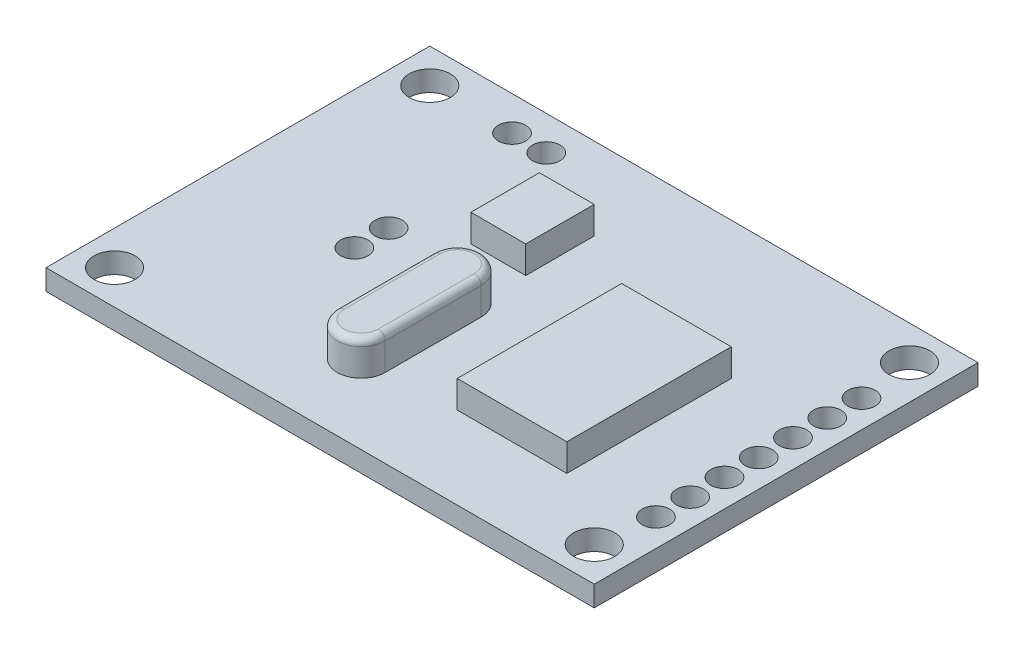
ISO-10303-21;
HEADER;
FILE_DESCRIPTION(('STEP AP214'),'2;1');
FILE_NAME('part.step','',(''),(''),'','','');
FILE_SCHEMA(('AUTOMOTIVE_DESIGN { 1 0 10303 214 1 1 1 1 }'));
ENDSEC;
DATA;
#1=APPLICATION_CONTEXT('core data for automotive mechanical design processes');
#2=APPLICATION_PROTOCOL_DEFINITION('international standard','automotive_design',2000,#1);
#3=PRODUCT_CONTEXT('',#1,'mechanical');
#4=PRODUCT('Part','Part','',(#3));
#5=PRODUCT_RELATED_PRODUCT_CATEGORY('part','',(#4));
#6=PRODUCT_DEFINITION_FORMATION('','',#4);
#7=PRODUCT_DEFINITION_CONTEXT('part definition',#1,'design');
#8=PRODUCT_DEFINITION('design','',#6,#7);
#9=PRODUCT_DEFINITION_SHAPE('','',#8);
#10=(LENGTH_UNIT() NAMED_UNIT(*) SI_UNIT(.MILLI.,.METRE.));
#11=(NAMED_UNIT(*) PLANE_ANGLE_UNIT() SI_UNIT($,.RADIAN.));
#12=(NAMED_UNIT(*) SI_UNIT($,.STERADIAN.) SOLID_ANGLE_UNIT());
#13=UNCERTAINTY_MEASURE_WITH_UNIT(LENGTH_MEASURE(1.E-05),#10,'distance_accuracy_value','');
#14=(GEOMETRIC_REPRESENTATION_CONTEXT(3) GLOBAL_UNCERTAINTY_ASSIGNED_CONTEXT((#13)) GLOBAL_UNIT_ASSIGNED_CONTEXT((#10,
#11,#12)) REPRESENTATION_CONTEXT('',''));
#15=CARTESIAN_POINT('',(0.,0.,0.));
#16=DIRECTION('',(0.,0.,1.));
#17=DIRECTION('',(1.,0.,0.));
#18=AXIS2_PLACEMENT_3D('',#15,#16,#17);
#19=CARTESIAN_POINT('',(0.,1.5,0.));
#20=DIRECTION('',(0.,-1.,0.));
#21=DIRECTION('',(0.,0.,-1.));
#22=AXIS2_PLACEMENT_3D('',#19,#20,#21);
#23=PLANE('',#22);
#24=DIRECTION('',(0.,0.,1.));
#25=VECTOR('',#24,1.);
#26=CARTESIAN_POINT('',(14.,1.5,-22.));
#27=LINE('',#26,#25);
#28=CARTESIAN_POINT('',(14.,1.5,-22.));
#29=VERTEX_POINT('',#28);
#30=CARTESIAN_POINT('',(14.,1.5,-17.));
#31=VERTEX_POINT('',#30);
#32=EDGE_CURVE('E236',#29,#31,#27,.T.);
#33=ORIENTED_EDGE('',*,*,#32,.F.);
#34=DIRECTION('',(-1.,0.,0.));
#35=VECTOR('',#34,1.);
#36=CARTESIAN_POINT('',(14.,1.5,-22.));
#37=LINE('',#36,#35);
#38=CARTESIAN_POINT('',(18.,1.5,-22.));
#39=VERTEX_POINT('',#38);
#40=EDGE_CURVE('E245',#39,#29,#37,.T.);
#41=ORIENTED_EDGE('',*,*,#40,.F.);
#42=DIRECTION('',(0.,0.,-1.));
#43=VECTOR('',#42,1.);
#44=CARTESIAN_POINT('',(18.,1.5,-22.));
#45=LINE('',#44,#43);
#46=CARTESIAN_POINT('',(18.,1.5,-17.));
#47=VERTEX_POINT('',#46);
#48=EDGE_CURVE('E262',#47,#39,#45,.T.);
#49=ORIENTED_EDGE('',*,*,#48,.F.);
#50=DIRECTION('',(1.,0.,0.));
#51=VECTOR('',#50,1.);
#52=CARTESIAN_POINT('',(14.,1.5,-17.));
#53=LINE('',#52,#51);
#54=EDGE_CURVE('E258',#31,#47,#53,.T.);
#55=ORIENTED_EDGE('',*,*,#54,.F.);
#56=EDGE_LOOP('',(#33,#41,#49,#55));
#57=FACE_BOUND('',#56,.T.);
#58=CARTESIAN_POINT('',(37.5,1.5,-2.5));
#59=DIRECTION('',(0.,1.,0.));
#60=DIRECTION('',(0.,0.,1.));
#61=AXIS2_PLACEMENT_3D('',#58,#59,#60);
#62=CIRCLE('',#61,1.5);
#63=CARTESIAN_POINT('',(37.5,1.5,-0.999999999999996));
#64=VERTEX_POINT('',#63);
#65=EDGE_CURVE('E386',#64,#64,#62,.T.);
#66=ORIENTED_EDGE('',*,*,#65,.F.);
#67=EDGE_LOOP('',(#66));
#68=FACE_BOUND('',#67,.T.);
#69=CARTESIAN_POINT('',(37.5,1.5,-25.5));
#70=DIRECTION('',(0.,1.,0.));
#71=DIRECTION('',(0.,0.,1.));
#72=AXIS2_PLACEMENT_3D('',#69,#70,#71);
#73=CIRCLE('',#72,1.5);
#74=CARTESIAN_POINT('',(37.5,1.5,-24.));
#75=VERTEX_POINT('',#74);
#76=EDGE_CURVE('E394',#75,#75,#73,.T.);
#77=ORIENTED_EDGE('',*,*,#76,.F.);
#78=EDGE_LOOP('',(#77));
#79=FACE_BOUND('',#78,.T.);
#80=CARTESIAN_POINT('',(2.5,1.5,-2.5));
#81=DIRECTION('',(0.,1.,0.));
#82=DIRECTION('',(0.,0.,1.));
#83=AXIS2_PLACEMENT_3D('',#80,#81,#82);
#84=CIRCLE('',#83,1.5);
#85=CARTESIAN_POINT('',(2.5,1.5,-0.999999999999999));
#86=VERTEX_POINT('',#85);
#87=EDGE_CURVE('E402',#86,#86,#84,.T.);
#88=ORIENTED_EDGE('',*,*,#87,.F.);
#89=EDGE_LOOP('',(#88));
#90=FACE_BOUND('',#89,.T.);
#91=CARTESIAN_POINT('',(2.5,1.5,-25.5));
#92=DIRECTION('',(0.,1.,0.));
#93=DIRECTION('',(0.,0.,1.));
#94=AXIS2_PLACEMENT_3D('',#91,#92,#93);
#95=CIRCLE('',#94,1.5);
#96=CARTESIAN_POINT('',(2.5,1.5,-24.));
#97=VERTEX_POINT('',#96);
#98=EDGE_CURVE('E410',#97,#97,#95,.T.);
#99=ORIENTED_EDGE('',*,*,#98,.F.);
#100=EDGE_LOOP('',(#99));
#101=FACE_BOUND('',#100,.T.);
#102=DIRECTION('',(0.,0.,1.));
#103=VECTOR('',#102,1.);
#104=CARTESIAN_POINT('',(0.,1.5,0.));
#105=LINE('',#104,#103);
#106=CARTESIAN_POINT('',(0.,1.5,-28.));
#107=VERTEX_POINT('',#106);
#108=CARTESIAN_POINT('',(0.,1.5,0.));
#109=VERTEX_POINT('',#108);
#110=EDGE_CURVE('E418',#107,#109,#105,.T.);
#111=ORIENTED_EDGE('',*,*,#110,.T.);
#112=DIRECTION('',(1.,0.,0.));
#113=VECTOR('',#112,1.);
#114=CARTESIAN_POINT('',(0.,1.5,0.));
#115=LINE('',#114,#113);
#116=CARTESIAN_POINT('',(40.,1.5,0.));
#117=VERTEX_POINT('',#116);
#118=EDGE_CURVE('E422',#109,#117,#115,.T.);
#119=ORIENTED_EDGE('',*,*,#118,.T.);
#120=DIRECTION('',(0.,0.,-1.));
#121=VECTOR('',#120,1.);
#122=CARTESIAN_POINT('',(40.,1.5,0.));
#123=LINE('',#122,#121);
#124=CARTESIAN_POINT('',(40.,1.5,-28.));
#125=VERTEX_POINT('',#124);
#126=EDGE_CURVE('E426',#117,#125,#123,.T.);
#127=ORIENTED_EDGE('',*,*,#126,.T.);
#128=DIRECTION('',(-1.,0.,0.));
#129=VECTOR('',#128,1.);
#130=CARTESIAN_POINT('',(0.,1.5,-28.));
#131=LINE('',#130,#129);
#132=EDGE_CURVE('E429',#125,#107,#131,.T.);
#133=ORIENTED_EDGE('',*,*,#132,.T.);
#134=EDGE_LOOP('',(#111,#119,#127,#133));
#135=FACE_BOUND('',#134,.T.);
#136=CARTESIAN_POINT('',(38.,1.5,-21.5));
#137=DIRECTION('',(0.,1.,0.));
#138=DIRECTION('',(0.,0.,1.));
#139=AXIS2_PLACEMENT_3D('',#136,#137,#138);
#140=CIRCLE('',#139,0.999999999999998);
#141=CARTESIAN_POINT('',(38.,1.5,-20.5));
#142=VERTEX_POINT('',#141);
#143=EDGE_CURVE('E379',#142,#142,#140,.T.);
#144=ORIENTED_EDGE('',*,*,#143,.F.);
#145=EDGE_LOOP('',(#144));
#146=FACE_BOUND('',#145,.T.);
#147=CARTESIAN_POINT('',(38.,1.5,-19.));
#148=DIRECTION('',(0.,1.,0.));
#149=DIRECTION('',(0.,0.,1.));
#150=AXIS2_PLACEMENT_3D('',#147,#148,#149);
#151=CIRCLE('',#150,0.999999999999998);
#152=CARTESIAN_POINT('',(38.,1.5,-18.));
#153=VERTEX_POINT('',#152);
#154=EDGE_CURVE('E371',#153,#153,#151,.T.);
#155=ORIENTED_EDGE('',*,*,#154,.F.);
#156=EDGE_LOOP('',(#155));
#157=FACE_BOUND('',#156,.T.);
#158=CARTESIAN_POINT('',(38.,1.5,-16.5));
#159=DIRECTION('',(0.,1.,0.));
#160=DIRECTION('',(0.,0.,1.));
#161=AXIS2_PLACEMENT_3D('',#158,#159,#160);
#162=CIRCLE('',#161,0.999999999999998);
#163=CARTESIAN_POINT('',(38.,1.5,-15.5));
#164=VERTEX_POINT('',#163);
#165=EDGE_CURVE('E363',#164,#164,#162,.T.);
#166=ORIENTED_EDGE('',*,*,#165,.F.);
#167=EDGE_LOOP('',(#166));
#168=FACE_BOUND('',#167,.T.);
#169=CARTESIAN_POINT('',(38.,1.5,-14.));
#170=DIRECTION('',(0.,1.,0.));
#171=DIRECTION('',(0.,0.,1.));
#172=AXIS2_PLACEMENT_3D('',#169,#170,#171);
#173=CIRCLE('',#172,0.999999999999998);
#174=CARTESIAN_POINT('',(38.,1.5,-13.));
#175=VERTEX_POINT('',#174);
#176=EDGE_CURVE('E355',#175,#175,#173,.T.);
#177=ORIENTED_EDGE('',*,*,#176,.F.);
#178=EDGE_LOOP('',(#177));
#179=FACE_BOUND('',#178,.T.);
#180=CARTESIAN_POINT('',(38.,1.5,-11.5));
#181=DIRECTION('',(0.,1.,0.));
#182=DIRECTION('',(0.,0.,1.));
#183=AXIS2_PLACEMENT_3D('',#180,#181,#182);
#184=CIRCLE('',#183,0.999999999999998);
#185=CARTESIAN_POINT('',(38.,1.5,-10.5));
#186=VERTEX_POINT('',#185);
#187=EDGE_CURVE('E347',#186,#186,#184,.T.);
#188=ORIENTED_EDGE('',*,*,#187,.F.);
#189=EDGE_LOOP('',(#188));
#190=FACE_BOUND('',#189,.T.);
#191=CARTESIAN_POINT('',(38.,1.5,-9.));
#192=DIRECTION('',(0.,1.,0.));
#193=DIRECTION('',(0.,0.,1.));
#194=AXIS2_PLACEMENT_3D('',#191,#192,#193);
#195=CIRCLE('',#194,0.999999999999998);
#196=CARTESIAN_POINT('',(38.,1.5,-8.));
#197=VERTEX_POINT('',#196);
#198=EDGE_CURVE('E339',#197,#197,#195,.T.);
#199=ORIENTED_EDGE('',*,*,#198,.F.);
#200=EDGE_LOOP('',(#199));
#201=FACE_BOUND('',#200,.T.);
#202=CARTESIAN_POINT('',(38.,1.5,-6.5));
#203=DIRECTION('',(0.,1.,0.));
#204=DIRECTION('',(0.,0.,1.));
#205=AXIS2_PLACEMENT_3D('',#202,#203,#204);
#206=CIRCLE('',#205,0.999999999999998);
#207=CARTESIAN_POINT('',(38.,1.5,-5.5));
#208=VERTEX_POINT('',#207);
#209=EDGE_CURVE('E335',#208,#208,#206,.T.);
#210=ORIENTED_EDGE('',*,*,#209,.F.);
#211=EDGE_LOOP('',(#210));
#212=FACE_BOUND('',#211,.T.);
#213=DIRECTION('',(0.,0.,1.));
#214=VECTOR('',#213,1.);
#215=CARTESIAN_POINT('',(24.,1.5,-18.));
#216=LINE('',#215,#214);
#217=CARTESIAN_POINT('',(24.,1.5,-18.));
#218=VERTEX_POINT('',#217);
#219=CARTESIAN_POINT('',(24.,1.5,-6.));
#220=VERTEX_POINT('',#219);
#221=EDGE_CURVE('E284',#218,#220,#216,.T.);
#222=ORIENTED_EDGE('',*,*,#221,.F.);
#223=DIRECTION('',(-1.,0.,0.));
#224=VECTOR('',#223,1.);
#225=CARTESIAN_POINT('',(24.,1.5,-18.));
#226=LINE('',#225,#224);
#227=CARTESIAN_POINT('',(32.,1.5,-18.));
#228=VERTEX_POINT('',#227);
#229=EDGE_CURVE('E290',#228,#218,#226,.T.);
#230=ORIENTED_EDGE('',*,*,#229,.F.);
#231=DIRECTION('',(0.,0.,-1.));
#232=VECTOR('',#231,1.);
#233=CARTESIAN_POINT('',(32.,1.5,-18.));
#234=LINE('',#233,#232);
#235=CARTESIAN_POINT('',(32.,1.5,-6.));
#236=VERTEX_POINT('',#235);
#237=EDGE_CURVE('E307',#236,#228,#234,.T.);
#238=ORIENTED_EDGE('',*,*,#237,.F.);
#239=DIRECTION('',(1.,0.,0.));
#240=VECTOR('',#239,1.);
#241=CARTESIAN_POINT('',(24.,1.5,-6.));
#242=LINE('',#241,#240);
#243=EDGE_CURVE('E303',#220,#236,#242,.T.);
#244=ORIENTED_EDGE('',*,*,#243,.F.);
#245=EDGE_LOOP('',(#222,#230,#238,#244));
#246=FACE_BOUND('',#245,.T.);
#247=CARTESIAN_POINT('',(10.,1.5,-15.));
#248=DIRECTION('',(0.,1.,0.));
#249=DIRECTION('',(0.,0.,1.));
#250=AXIS2_PLACEMENT_3D('',#247,#248,#249);
#251=CIRCLE('',#250,1.);
#252=CARTESIAN_POINT('',(10.,1.5,-14.));
#253=VERTEX_POINT('',#252);
#254=EDGE_CURVE('E220',#253,#253,#251,.T.);
#255=ORIENTED_EDGE('',*,*,#254,.F.);
#256=EDGE_LOOP('',(#255));
#257=FACE_BOUND('',#256,.T.);
#258=CARTESIAN_POINT('',(11.,1.5,-25.5));
#259=DIRECTION('',(0.,1.,0.));
#260=DIRECTION('',(0.,0.,1.));
#261=AXIS2_PLACEMENT_3D('',#258,#259,#260);
#262=CIRCLE('',#261,1.);
#263=CARTESIAN_POINT('',(11.,1.5,-24.5));
#264=VERTEX_POINT('',#263);
#265=EDGE_CURVE('E208',#264,#264,#262,.T.);
#266=ORIENTED_EDGE('',*,*,#265,.F.);
#267=EDGE_LOOP('',(#266));
#268=FACE_BOUND('',#267,.T.);
#269=CARTESIAN_POINT('',(8.5,1.5,-25.5));
#270=DIRECTION('',(0.,1.,0.));
#271=DIRECTION('',(0.,0.,1.));
#272=AXIS2_PLACEMENT_3D('',#269,#270,#271);
#273=CIRCLE('',#272,1.);
#274=CARTESIAN_POINT('',(8.5,1.5,-24.5));
#275=VERTEX_POINT('',#274);
#276=EDGE_CURVE('E225',#275,#275,#273,.T.);
#277=ORIENTED_EDGE('',*,*,#276,.F.);
#278=EDGE_LOOP('',(#277));
#279=FACE_BOUND('',#278,.T.);
#280=CARTESIAN_POINT('',(10.,1.5,-12.5));
#281=DIRECTION('',(0.,1.,0.));
#282=DIRECTION('',(0.,0.,1.));
#283=AXIS2_PLACEMENT_3D('',#280,#281,#282);
#284=CIRCLE('',#283,1.);
#285=CARTESIAN_POINT('',(10.,1.5,-11.5));
#286=VERTEX_POINT('',#285);
#287=EDGE_CURVE('E216',#286,#286,#284,.T.);
#288=ORIENTED_EDGE('',*,*,#287,.F.);
#289=EDGE_LOOP('',(#288));
#290=FACE_BOUND('',#289,.T.);
#291=CARTESIAN_POINT('',(17.25,1.5,-12.75));
#292=DIRECTION('',(0.,1.,0.));
#293=DIRECTION('',(0.,0.,1.));
#294=AXIS2_PLACEMENT_3D('',#291,#292,#293);
#295=CIRCLE('',#294,1.75);
#296=CARTESIAN_POINT('',(19.,1.5,-12.75));
#297=VERTEX_POINT('',#296);
#298=CARTESIAN_POINT('',(15.5,1.5,-12.75));
#299=VERTEX_POINT('',#298);
#300=EDGE_CURVE('E173',#297,#299,#295,.T.);
#301=ORIENTED_EDGE('',*,*,#300,.F.);
#302=DIRECTION('',(0.,0.,-1.));
#303=VECTOR('',#302,1.);
#304=CARTESIAN_POINT('',(19.,1.5,-12.75));
#305=LINE('',#304,#303);
#306=CARTESIAN_POINT('',(19.,1.5,-5.74999999999999));
#307=VERTEX_POINT('',#306);
#308=EDGE_CURVE('E179',#307,#297,#305,.T.);
#309=ORIENTED_EDGE('',*,*,#308,.F.);
#310=CARTESIAN_POINT('',(17.25,1.5,-5.74999999999999));
#311=DIRECTION('',(0.,1.,0.));
#312=DIRECTION('',(0.,0.,1.));
#313=AXIS2_PLACEMENT_3D('',#310,#311,#312);
#314=CIRCLE('',#313,1.75);
#315=CARTESIAN_POINT('',(15.5,1.5,-5.74999999999999));
#316=VERTEX_POINT('',#315);
#317=EDGE_CURVE('E193',#316,#307,#314,.T.);
#318=ORIENTED_EDGE('',*,*,#317,.F.);
#319=DIRECTION('',(0.,0.,1.));
#320=VECTOR('',#319,1.);
#321=CARTESIAN_POINT('',(15.5,1.5,-12.75));
#322=LINE('',#321,#320);
#323=EDGE_CURVE('E187',#299,#316,#322,.T.);
#324=ORIENTED_EDGE('',*,*,#323,.F.);
#325=EDGE_LOOP('',(#301,#309,#318,#324));
#326=FACE_BOUND('',#325,.T.);
#327=ADVANCED_FACE('F45',(#57,#68,#79,#90,#101,#135,#146,#157,#168,#179,#190,#201,#212,#246,
#257,#268,#279,#290,#326),#23,.F.);
#328=CARTESIAN_POINT('',(0.,0.,0.));
#329=DIRECTION('',(0.,-1.,0.));
#330=DIRECTION('',(0.,0.,-1.));
#331=AXIS2_PLACEMENT_3D('',#328,#329,#330);
#332=PLANE('',#331);
#333=CARTESIAN_POINT('',(10.,0.,-12.5));
#334=DIRECTION('',(0.,1.,0.));
#335=DIRECTION('',(0.,0.,1.));
#336=AXIS2_PLACEMENT_3D('',#333,#334,#335);
#337=CIRCLE('',#336,1.);
#338=CARTESIAN_POINT('',(10.,0.,-11.5));
#339=VERTEX_POINT('',#338);
#340=EDGE_CURVE('E221',#339,#339,#337,.T.);
#341=ORIENTED_EDGE('',*,*,#340,.T.);
#342=EDGE_LOOP('',(#341));
#343=FACE_BOUND('',#342,.T.);
#344=CARTESIAN_POINT('',(8.5,0.,-25.5));
#345=DIRECTION('',(0.,1.,0.));
#346=DIRECTION('',(0.,0.,1.));
#347=AXIS2_PLACEMENT_3D('',#344,#345,#346);
#348=CIRCLE('',#347,1.);
#349=CARTESIAN_POINT('',(8.5,0.,-24.5));
#350=VERTEX_POINT('',#349);
#351=EDGE_CURVE('E212',#350,#350,#348,.T.);
#352=ORIENTED_EDGE('',*,*,#351,.T.);
#353=EDGE_LOOP('',(#352));
#354=FACE_BOUND('',#353,.T.);
#355=CARTESIAN_POINT('',(11.,0.,-25.5));
#356=DIRECTION('',(0.,1.,0.));
#357=DIRECTION('',(0.,0.,1.));
#358=AXIS2_PLACEMENT_3D('',#355,#356,#357);
#359=CIRCLE('',#358,1.);
#360=CARTESIAN_POINT('',(11.,0.,-24.5));
#361=VERTEX_POINT('',#360);
#362=EDGE_CURVE('E207',#361,#361,#359,.T.);
#363=ORIENTED_EDGE('',*,*,#362,.T.);
#364=EDGE_LOOP('',(#363));
#365=FACE_BOUND('',#364,.T.);
#366=CARTESIAN_POINT('',(10.,0.,-15.));
#367=DIRECTION('',(0.,1.,0.));
#368=DIRECTION('',(0.,0.,1.));
#369=AXIS2_PLACEMENT_3D('',#366,#367,#368);
#370=CIRCLE('',#369,1.);
#371=CARTESIAN_POINT('',(10.,0.,-14.));
#372=VERTEX_POINT('',#371);
#373=EDGE_CURVE('E232',#372,#372,#370,.T.);
#374=ORIENTED_EDGE('',*,*,#373,.T.);
#375=EDGE_LOOP('',(#374));
#376=FACE_BOUND('',#375,.T.);
#377=CARTESIAN_POINT('',(38.,0.,-6.5));
#378=DIRECTION('',(0.,1.,0.));
#379=DIRECTION('',(0.,0.,1.));
#380=AXIS2_PLACEMENT_3D('',#377,#378,#379);
#381=CIRCLE('',#380,0.999999999999998);
#382=CARTESIAN_POINT('',(38.,0.,-5.5));
#383=VERTEX_POINT('',#382);
#384=EDGE_CURVE('E330',#383,#383,#381,.T.);
#385=ORIENTED_EDGE('',*,*,#384,.T.);
#386=EDGE_LOOP('',(#385));
#387=FACE_BOUND('',#386,.T.);
#388=CARTESIAN_POINT('',(38.,0.,-9.));
#389=DIRECTION('',(0.,1.,0.));
#390=DIRECTION('',(0.,0.,1.));
#391=AXIS2_PLACEMENT_3D('',#388,#389,#390);
#392=CIRCLE('',#391,0.999999999999998);
#393=CARTESIAN_POINT('',(38.,0.,-8.));
#394=VERTEX_POINT('',#393);
#395=EDGE_CURVE('E343',#394,#394,#392,.T.);
#396=ORIENTED_EDGE('',*,*,#395,.T.);
#397=EDGE_LOOP('',(#396));
#398=FACE_BOUND('',#397,.T.);
#399=CARTESIAN_POINT('',(38.,0.,-11.5));
#400=DIRECTION('',(0.,1.,0.));
#401=DIRECTION('',(0.,0.,1.));
#402=AXIS2_PLACEMENT_3D('',#399,#400,#401);
#403=CIRCLE('',#402,0.999999999999998);
#404=CARTESIAN_POINT('',(38.,0.,-10.5));
#405=VERTEX_POINT('',#404);
#406=EDGE_CURVE('E351',#405,#405,#403,.T.);
#407=ORIENTED_EDGE('',*,*,#406,.T.);
#408=EDGE_LOOP('',(#407));
#409=FACE_BOUND('',#408,.T.);
#410=CARTESIAN_POINT('',(38.,0.,-14.));
#411=DIRECTION('',(0.,1.,0.));
#412=DIRECTION('',(0.,0.,1.));
#413=AXIS2_PLACEMENT_3D('',#410,#411,#412);
#414=CIRCLE('',#413,0.999999999999998);
#415=CARTESIAN_POINT('',(38.,0.,-13.));
#416=VERTEX_POINT('',#415);
#417=EDGE_CURVE('E359',#416,#416,#414,.T.);
#418=ORIENTED_EDGE('',*,*,#417,.T.);
#419=EDGE_LOOP('',(#418));
#420=FACE_BOUND('',#419,.T.);
#421=CARTESIAN_POINT('',(38.,0.,-16.5));
#422=DIRECTION('',(0.,1.,0.));
#423=DIRECTION('',(0.,0.,1.));
#424=AXIS2_PLACEMENT_3D('',#421,#422,#423);
#425=CIRCLE('',#424,0.999999999999998);
#426=CARTESIAN_POINT('',(38.,0.,-15.5));
#427=VERTEX_POINT('',#426);
#428=EDGE_CURVE('E367',#427,#427,#425,.T.);
#429=ORIENTED_EDGE('',*,*,#428,.T.);
#430=EDGE_LOOP('',(#429));
#431=FACE_BOUND('',#430,.T.);
#432=CARTESIAN_POINT('',(38.,0.,-19.));
#433=DIRECTION('',(0.,1.,0.));
#434=DIRECTION('',(0.,0.,1.));
#435=AXIS2_PLACEMENT_3D('',#432,#433,#434);
#436=CIRCLE('',#435,0.999999999999998);
#437=CARTESIAN_POINT('',(38.,0.,-18.));
#438=VERTEX_POINT('',#437);
#439=EDGE_CURVE('E375',#438,#438,#436,.T.);
#440=ORIENTED_EDGE('',*,*,#439,.T.);
#441=EDGE_LOOP('',(#440));
#442=FACE_BOUND('',#441,.T.);
#443=CARTESIAN_POINT('',(38.,0.,-21.5));
#444=DIRECTION('',(0.,1.,0.));
#445=DIRECTION('',(0.,0.,1.));
#446=AXIS2_PLACEMENT_3D('',#443,#444,#445);
#447=CIRCLE('',#446,0.999999999999998);
#448=CARTESIAN_POINT('',(38.,0.,-20.5));
#449=VERTEX_POINT('',#448);
#450=EDGE_CURVE('E329',#449,#449,#447,.T.);
#451=ORIENTED_EDGE('',*,*,#450,.T.);
#452=EDGE_LOOP('',(#451));
#453=FACE_BOUND('',#452,.T.);
#454=CARTESIAN_POINT('',(37.5,0.,-25.5));
#455=DIRECTION('',(0.,1.,0.));
#456=DIRECTION('',(0.,0.,1.));
#457=AXIS2_PLACEMENT_3D('',#454,#455,#456);
#458=CIRCLE('',#457,1.5);
#459=CARTESIAN_POINT('',(37.5,0.,-24.));
#460=VERTEX_POINT('',#459);
#461=EDGE_CURVE('E390',#460,#460,#458,.T.);
#462=ORIENTED_EDGE('',*,*,#461,.T.);
#463=EDGE_LOOP('',(#462));
#464=FACE_BOUND('',#463,.T.);
#465=CARTESIAN_POINT('',(2.5,0.,-25.5));
#466=DIRECTION('',(0.,1.,0.));
#467=DIRECTION('',(0.,0.,1.));
#468=AXIS2_PLACEMENT_3D('',#465,#466,#467);
#469=CIRCLE('',#468,1.5);
#470=CARTESIAN_POINT('',(2.5,0.,-24.));
#471=VERTEX_POINT('',#470);
#472=EDGE_CURVE('E406',#471,#471,#469,.T.);
#473=ORIENTED_EDGE('',*,*,#472,.T.);
#474=EDGE_LOOP('',(#473));
#475=FACE_BOUND('',#474,.T.);
#476=DIRECTION('',(0.,0.,1.));
#477=VECTOR('',#476,1.);
#478=CARTESIAN_POINT('',(0.,0.,0.));
#479=LINE('',#478,#477);
#480=CARTESIAN_POINT('',(0.,0.,-28.));
#481=VERTEX_POINT('',#480);
#482=CARTESIAN_POINT('',(0.,0.,0.));
#483=VERTEX_POINT('',#482);
#484=EDGE_CURVE('E414',#481,#483,#479,.T.);
#485=ORIENTED_EDGE('',*,*,#484,.F.);
#486=DIRECTION('',(-1.,0.,0.));
#487=VECTOR('',#486,1.);
#488=CARTESIAN_POINT('',(0.,0.,-28.));
#489=LINE('',#488,#487);
#490=CARTESIAN_POINT('',(40.,0.,-28.));
#491=VERTEX_POINT('',#490);
#492=EDGE_CURVE('E423',#491,#481,#489,.T.);
#493=ORIENTED_EDGE('',*,*,#492,.F.);
#494=DIRECTION('',(0.,0.,-1.));
#495=VECTOR('',#494,1.);
#496=CARTESIAN_POINT('',(40.,0.,0.));
#497=LINE('',#496,#495);
#498=CARTESIAN_POINT('',(40.,0.,0.));
#499=VERTEX_POINT('',#498);
#500=EDGE_CURVE('E439',#499,#491,#497,.T.);
#501=ORIENTED_EDGE('',*,*,#500,.F.);
#502=DIRECTION('',(1.,0.,0.));
#503=VECTOR('',#502,1.);
#504=CARTESIAN_POINT('',(0.,0.,0.));
#505=LINE('',#504,#503);
#506=EDGE_CURVE('E436',#483,#499,#505,.T.);
#507=ORIENTED_EDGE('',*,*,#506,.F.);
#508=EDGE_LOOP('',(#485,#493,#501,#507));
#509=FACE_BOUND('',#508,.T.);
#510=CARTESIAN_POINT('',(2.5,0.,-2.5));
#511=DIRECTION('',(0.,1.,0.));
#512=DIRECTION('',(0.,0.,1.));
#513=AXIS2_PLACEMENT_3D('',#510,#511,#512);
#514=CIRCLE('',#513,1.5);
#515=CARTESIAN_POINT('',(2.5,0.,-0.999999999999999));
#516=VERTEX_POINT('',#515);
#517=EDGE_CURVE('E398',#516,#516,#514,.T.);
#518=ORIENTED_EDGE('',*,*,#517,.T.);
#519=EDGE_LOOP('',(#518));
#520=FACE_BOUND('',#519,.T.);
#521=CARTESIAN_POINT('',(37.5,0.,-2.5));
#522=DIRECTION('',(0.,1.,0.));
#523=DIRECTION('',(0.,0.,1.));
#524=AXIS2_PLACEMENT_3D('',#521,#522,#523);
#525=CIRCLE('',#524,1.5);
#526=CARTESIAN_POINT('',(37.5,0.,-0.999999999999996));
#527=VERTEX_POINT('',#526);
#528=EDGE_CURVE('E334',#527,#527,#525,.T.);
#529=ORIENTED_EDGE('',*,*,#528,.T.);
#530=EDGE_LOOP('',(#529));
#531=FACE_BOUND('',#530,.T.);
#532=ADVANCED_FACE('F518',(#343,#354,#365,#376,#387,#398,#409,#420,#431,#442,#453,#464,#475,
#509,#520,#531),#332,.T.);
#533=CARTESIAN_POINT('',(0.,1.5,0.));
#534=DIRECTION('',(1.,0.,0.));
#535=DIRECTION('',(0.,0.,-1.));
#536=AXIS2_PLACEMENT_3D('',#533,#534,#535);
#537=PLANE('',#536);
#538=ORIENTED_EDGE('',*,*,#484,.T.);
#539=DIRECTION('',(0.,-1.,0.));
#540=VECTOR('',#539,1.);
#541=CARTESIAN_POINT('',(0.,1.5,0.));
#542=LINE('',#541,#540);
#543=EDGE_CURVE('E455',#109,#483,#542,.T.);
#544=ORIENTED_EDGE('',*,*,#543,.F.);
#545=ORIENTED_EDGE('',*,*,#110,.F.);
#546=DIRECTION('',(0.,-1.,0.));
#547=VECTOR('',#546,1.);
#548=CARTESIAN_POINT('',(0.,1.5,-28.));
#549=LINE('',#548,#547);
#550=EDGE_CURVE('E432',#107,#481,#549,.T.);
#551=ORIENTED_EDGE('',*,*,#550,.T.);
#552=EDGE_LOOP('',(#538,#544,#545,#551));
#553=FACE_BOUND('',#552,.T.);
#554=ADVANCED_FACE('F524',(#553),#537,.F.);
#555=CARTESIAN_POINT('',(0.,1.5,0.));
#556=DIRECTION('',(0.,0.,-1.));
#557=DIRECTION('',(-1.,0.,0.));
#558=AXIS2_PLACEMENT_3D('',#555,#556,#557);
#559=PLANE('',#558);
#560=ORIENTED_EDGE('',*,*,#506,.T.);
#561=DIRECTION('',(0.,-1.,0.));
#562=VECTOR('',#561,1.);
#563=CARTESIAN_POINT('',(40.,1.5,0.));
#564=LINE('',#563,#562);
#565=EDGE_CURVE('E451',#117,#499,#564,.T.);
#566=ORIENTED_EDGE('',*,*,#565,.F.);
#567=ORIENTED_EDGE('',*,*,#118,.F.);
#568=ORIENTED_EDGE('',*,*,#543,.T.);
#569=EDGE_LOOP('',(#560,#566,#567,#568));
#570=FACE_BOUND('',#569,.T.);
#571=ADVANCED_FACE('F539',(#570),#559,.F.);
#572=CARTESIAN_POINT('',(40.,1.5,0.));
#573=DIRECTION('',(-1.,0.,0.));
#574=DIRECTION('',(0.,0.,1.));
#575=AXIS2_PLACEMENT_3D('',#572,#573,#574);
#576=PLANE('',#575);
#577=ORIENTED_EDGE('',*,*,#500,.T.);
#578=DIRECTION('',(0.,-1.,0.));
#579=VECTOR('',#578,1.);
#580=CARTESIAN_POINT('',(40.,1.5,-28.));
#581=LINE('',#580,#579);
#582=EDGE_CURVE('E447',#125,#491,#581,.T.);
#583=ORIENTED_EDGE('',*,*,#582,.F.);
#584=ORIENTED_EDGE('',*,*,#126,.F.);
#585=ORIENTED_EDGE('',*,*,#565,.T.);
#586=EDGE_LOOP('',(#577,#583,#584,#585));
#587=FACE_BOUND('',#586,.T.);
#588=ADVANCED_FACE('F535',(#587),#576,.F.);
#589=CARTESIAN_POINT('',(0.,1.5,-28.));
#590=DIRECTION('',(0.,0.,1.));
#591=DIRECTION('',(1.,0.,0.));
#592=AXIS2_PLACEMENT_3D('',#589,#590,#591);
#593=PLANE('',#592);
#594=ORIENTED_EDGE('',*,*,#492,.T.);
#595=ORIENTED_EDGE('',*,*,#550,.F.);
#596=ORIENTED_EDGE('',*,*,#132,.F.);
#597=ORIENTED_EDGE('',*,*,#582,.T.);
#598=EDGE_LOOP('',(#594,#595,#596,#597));
#599=FACE_BOUND('',#598,.T.);
#600=ADVANCED_FACE('F532',(#599),#593,.F.);
#601=CARTESIAN_POINT('',(2.5,1.5,-25.5));
#602=DIRECTION('',(0.,-1.,0.));
#603=DIRECTION('',(0.,0.,-1.));
#604=AXIS2_PLACEMENT_3D('',#601,#602,#603);
#605=CYLINDRICAL_SURFACE('',#604,1.5);
#606=ORIENTED_EDGE('',*,*,#98,.T.);
#607=EDGE_LOOP('',(#606));
#608=FACE_BOUND('',#607,.T.);
#609=ORIENTED_EDGE('',*,*,#472,.F.);
#610=EDGE_LOOP('',(#609));
#611=FACE_BOUND('',#610,.T.);
#612=ADVANCED_FACE('F529',(#608,#611),#605,.F.);
#613=CARTESIAN_POINT('',(2.5,1.5,-2.5));
#614=DIRECTION('',(0.,-1.,0.));
#615=DIRECTION('',(0.,0.,-1.));
#616=AXIS2_PLACEMENT_3D('',#613,#614,#615);
#617=CYLINDRICAL_SURFACE('',#616,1.5);
#618=ORIENTED_EDGE('',*,*,#87,.T.);
#619=EDGE_LOOP('',(#618));
#620=FACE_BOUND('',#619,.T.);
#621=ORIENTED_EDGE('',*,*,#517,.F.);
#622=EDGE_LOOP('',(#621));
#623=FACE_BOUND('',#622,.T.);
#624=ADVANCED_FACE('F880',(#620,#623),#617,.F.);
#625=CARTESIAN_POINT('',(37.5,1.5,-25.5));
#626=DIRECTION('',(0.,-1.,0.));
#627=DIRECTION('',(0.,0.,-1.));
#628=AXIS2_PLACEMENT_3D('',#625,#626,#627);
#629=CYLINDRICAL_SURFACE('',#628,1.5);
#630=ORIENTED_EDGE('',*,*,#76,.T.);
#631=EDGE_LOOP('',(#630));
#632=FACE_BOUND('',#631,.T.);
#633=ORIENTED_EDGE('',*,*,#461,.F.);
#634=EDGE_LOOP('',(#633));
#635=FACE_BOUND('',#634,.T.);
#636=ADVANCED_FACE('F869',(#632,#635),#629,.F.);
#637=CARTESIAN_POINT('',(37.5,1.5,-2.5));
#638=DIRECTION('',(0.,-1.,0.));
#639=DIRECTION('',(0.,0.,-1.));
#640=AXIS2_PLACEMENT_3D('',#637,#638,#639);
#641=CYLINDRICAL_SURFACE('',#640,1.5);
#642=ORIENTED_EDGE('',*,*,#65,.T.);
#643=EDGE_LOOP('',(#642));
#644=FACE_BOUND('',#643,.T.);
#645=ORIENTED_EDGE('',*,*,#528,.F.);
#646=EDGE_LOOP('',(#645));
#647=FACE_BOUND('',#646,.T.);
#648=ADVANCED_FACE('F858',(#644,#647),#641,.F.);
#649=CARTESIAN_POINT('',(38.,0.,-21.5));
#650=DIRECTION('',(0.,1.,0.));
#651=DIRECTION('',(0.,0.,1.));
#652=AXIS2_PLACEMENT_3D('',#649,#650,#651);
#653=CYLINDRICAL_SURFACE('',#652,0.999999999999998);
#654=ORIENTED_EDGE('',*,*,#450,.F.);
#655=EDGE_LOOP('',(#654));
#656=FACE_BOUND('',#655,.T.);
#657=ORIENTED_EDGE('',*,*,#143,.T.);
#658=EDGE_LOOP('',(#657));
#659=FACE_BOUND('',#658,.T.);
#660=ADVANCED_FACE('F847',(#656,#659),#653,.F.);
#661=CARTESIAN_POINT('',(38.,0.,-19.));
#662=DIRECTION('',(0.,1.,0.));
#663=DIRECTION('',(0.,0.,1.));
#664=AXIS2_PLACEMENT_3D('',#661,#662,#663);
#665=CYLINDRICAL_SURFACE('',#664,0.999999999999998);
#666=ORIENTED_EDGE('',*,*,#439,.F.);
#667=EDGE_LOOP('',(#666));
#668=FACE_BOUND('',#667,.T.);
#669=ORIENTED_EDGE('',*,*,#154,.T.);
#670=EDGE_LOOP('',(#669));
#671=FACE_BOUND('',#670,.T.);
#672=ADVANCED_FACE('F836',(#668,#671),#665,.F.);
#673=CARTESIAN_POINT('',(38.,0.,-16.5));
#674=DIRECTION('',(0.,1.,0.));
#675=DIRECTION('',(0.,0.,1.));
#676=AXIS2_PLACEMENT_3D('',#673,#674,#675);
#677=CYLINDRICAL_SURFACE('',#676,0.999999999999998);
#678=ORIENTED_EDGE('',*,*,#428,.F.);
#679=EDGE_LOOP('',(#678));
#680=FACE_BOUND('',#679,.T.);
#681=ORIENTED_EDGE('',*,*,#165,.T.);
#682=EDGE_LOOP('',(#681));
#683=FACE_BOUND('',#682,.T.);
#684=ADVANCED_FACE('F825',(#680,#683),#677,.F.);
#685=CARTESIAN_POINT('',(38.,0.,-14.));
#686=DIRECTION('',(0.,1.,0.));
#687=DIRECTION('',(0.,0.,1.));
#688=AXIS2_PLACEMENT_3D('',#685,#686,#687);
#689=CYLINDRICAL_SURFACE('',#688,0.999999999999998);
#690=ORIENTED_EDGE('',*,*,#417,.F.);
#691=EDGE_LOOP('',(#690));
#692=FACE_BOUND('',#691,.T.);
#693=ORIENTED_EDGE('',*,*,#176,.T.);
#694=EDGE_LOOP('',(#693));
#695=FACE_BOUND('',#694,.T.);
#696=ADVANCED_FACE('F814',(#692,#695),#689,.F.);
#697=CARTESIAN_POINT('',(38.,0.,-11.5));
#698=DIRECTION('',(0.,1.,0.));
#699=DIRECTION('',(0.,0.,1.));
#700=AXIS2_PLACEMENT_3D('',#697,#698,#699);
#701=CYLINDRICAL_SURFACE('',#700,0.999999999999998);
#702=ORIENTED_EDGE('',*,*,#406,.F.);
#703=EDGE_LOOP('',(#702));
#704=FACE_BOUND('',#703,.T.);
#705=ORIENTED_EDGE('',*,*,#187,.T.);
#706=EDGE_LOOP('',(#705));
#707=FACE_BOUND('',#706,.T.);
#708=ADVANCED_FACE('F803',(#704,#707),#701,.F.);
#709=CARTESIAN_POINT('',(38.,0.,-9.));
#710=DIRECTION('',(0.,1.,0.));
#711=DIRECTION('',(0.,0.,1.));
#712=AXIS2_PLACEMENT_3D('',#709,#710,#711);
#713=CYLINDRICAL_SURFACE('',#712,0.999999999999998);
#714=ORIENTED_EDGE('',*,*,#395,.F.);
#715=EDGE_LOOP('',(#714));
#716=FACE_BOUND('',#715,.T.);
#717=ORIENTED_EDGE('',*,*,#198,.T.);
#718=EDGE_LOOP('',(#717));
#719=FACE_BOUND('',#718,.T.);
#720=ADVANCED_FACE('F792',(#716,#719),#713,.F.);
#721=CARTESIAN_POINT('',(38.,0.,-6.5));
#722=DIRECTION('',(0.,1.,0.));
#723=DIRECTION('',(0.,0.,1.));
#724=AXIS2_PLACEMENT_3D('',#721,#722,#723);
#725=CYLINDRICAL_SURFACE('',#724,0.999999999999998);
#726=ORIENTED_EDGE('',*,*,#384,.F.);
#727=EDGE_LOOP('',(#726));
#728=FACE_BOUND('',#727,.T.);
#729=ORIENTED_EDGE('',*,*,#209,.T.);
#730=EDGE_LOOP('',(#729));
#731=FACE_BOUND('',#730,.T.);
#732=ADVANCED_FACE('F781',(#728,#731),#725,.F.);
#733=CARTESIAN_POINT('',(24.,3.5,-18.));
#734=DIRECTION('',(1.,0.,0.));
#735=DIRECTION('',(0.,0.,-1.));
#736=AXIS2_PLACEMENT_3D('',#733,#734,#735);
#737=PLANE('',#736);
#738=ORIENTED_EDGE('',*,*,#221,.T.);
#739=DIRECTION('',(0.,-1.,0.));
#740=VECTOR('',#739,1.);
#741=CARTESIAN_POINT('',(24.,3.5,-6.));
#742=LINE('',#741,#740);
#743=CARTESIAN_POINT('',(24.,3.5,-6.));
#744=VERTEX_POINT('',#743);
#745=EDGE_CURVE('E325',#744,#220,#742,.T.);
#746=ORIENTED_EDGE('',*,*,#745,.F.);
#747=DIRECTION('',(0.,0.,1.));
#748=VECTOR('',#747,1.);
#749=CARTESIAN_POINT('',(24.,3.5,-18.));
#750=LINE('',#749,#748);
#751=CARTESIAN_POINT('',(24.,3.5,-18.));
#752=VERTEX_POINT('',#751);
#753=EDGE_CURVE('E285',#752,#744,#750,.T.);
#754=ORIENTED_EDGE('',*,*,#753,.F.);
#755=DIRECTION('',(0.,-1.,0.));
#756=VECTOR('',#755,1.);
#757=CARTESIAN_POINT('',(24.,3.5,-18.));
#758=LINE('',#757,#756);
#759=EDGE_CURVE('E299',#752,#218,#758,.T.);
#760=ORIENTED_EDGE('',*,*,#759,.T.);
#761=EDGE_LOOP('',(#738,#746,#754,#760));
#762=FACE_BOUND('',#761,.T.);
#763=ADVANCED_FACE('F770',(#762),#737,.F.);
#764=CARTESIAN_POINT('',(24.,3.5,-6.));
#765=DIRECTION('',(0.,0.,-1.));
#766=DIRECTION('',(-1.,0.,0.));
#767=AXIS2_PLACEMENT_3D('',#764,#765,#766);
#768=PLANE('',#767);
#769=ORIENTED_EDGE('',*,*,#243,.T.);
#770=DIRECTION('',(0.,-1.,0.));
#771=VECTOR('',#770,1.);
#772=CARTESIAN_POINT('',(32.,3.5,-6.));
#773=LINE('',#772,#771);
#774=CARTESIAN_POINT('',(32.,3.5,-6.));
#775=VERTEX_POINT('',#774);
#776=EDGE_CURVE('E321',#775,#236,#773,.T.);
#777=ORIENTED_EDGE('',*,*,#776,.F.);
#778=DIRECTION('',(1.,0.,0.));
#779=VECTOR('',#778,1.);
#780=CARTESIAN_POINT('',(24.,3.5,-6.));
#781=LINE('',#780,#779);
#782=EDGE_CURVE('E289',#744,#775,#781,.T.);
#783=ORIENTED_EDGE('',*,*,#782,.F.);
#784=ORIENTED_EDGE('',*,*,#745,.T.);
#785=EDGE_LOOP('',(#769,#777,#783,#784));
#786=FACE_BOUND('',#785,.T.);
#787=ADVANCED_FACE('F759',(#786),#768,.F.);
#788=CARTESIAN_POINT('',(32.,3.5,-18.));
#789=DIRECTION('',(-1.,0.,0.));
#790=DIRECTION('',(0.,0.,1.));
#791=AXIS2_PLACEMENT_3D('',#788,#789,#790);
#792=PLANE('',#791);
#793=ORIENTED_EDGE('',*,*,#237,.T.);
#794=DIRECTION('',(0.,-1.,0.));
#795=VECTOR('',#794,1.);
#796=CARTESIAN_POINT('',(32.,3.5,-18.));
#797=LINE('',#796,#795);
#798=CARTESIAN_POINT('',(32.,3.5,-18.));
#799=VERTEX_POINT('',#798);
#800=EDGE_CURVE('E317',#799,#228,#797,.T.);
#801=ORIENTED_EDGE('',*,*,#800,.F.);
#802=DIRECTION('',(0.,0.,-1.));
#803=VECTOR('',#802,1.);
#804=CARTESIAN_POINT('',(32.,3.5,-18.));
#805=LINE('',#804,#803);
#806=EDGE_CURVE('E293',#775,#799,#805,.T.);
#807=ORIENTED_EDGE('',*,*,#806,.F.);
#808=ORIENTED_EDGE('',*,*,#776,.T.);
#809=EDGE_LOOP('',(#793,#801,#807,#808));
#810=FACE_BOUND('',#809,.T.);
#811=ADVANCED_FACE('F748',(#810),#792,.F.);
#812=CARTESIAN_POINT('',(24.,3.5,-18.));
#813=DIRECTION('',(0.,0.,1.));
#814=DIRECTION('',(1.,0.,0.));
#815=AXIS2_PLACEMENT_3D('',#812,#813,#814);
#816=PLANE('',#815);
#817=ORIENTED_EDGE('',*,*,#229,.T.);
#818=ORIENTED_EDGE('',*,*,#759,.F.);
#819=DIRECTION('',(-1.,0.,0.));
#820=VECTOR('',#819,1.);
#821=CARTESIAN_POINT('',(24.,3.5,-18.));
#822=LINE('',#821,#820);
#823=EDGE_CURVE('E296',#799,#752,#822,.T.);
#824=ORIENTED_EDGE('',*,*,#823,.F.);
#825=ORIENTED_EDGE('',*,*,#800,.T.);
#826=EDGE_LOOP('',(#817,#818,#824,#825));
#827=FACE_BOUND('',#826,.T.);
#828=ADVANCED_FACE('F737',(#827),#816,.F.);
#829=CARTESIAN_POINT('',(0.,3.5,0.));
#830=DIRECTION('',(0.,1.,0.));
#831=DIRECTION('',(0.,0.,1.));
#832=AXIS2_PLACEMENT_3D('',#829,#830,#831);
#833=PLANE('',#832);
#834=ORIENTED_EDGE('',*,*,#753,.T.);
#835=ORIENTED_EDGE('',*,*,#782,.T.);
#836=ORIENTED_EDGE('',*,*,#806,.T.);
#837=ORIENTED_EDGE('',*,*,#823,.T.);
#838=EDGE_LOOP('',(#834,#835,#836,#837));
#839=FACE_BOUND('',#838,.T.);
#840=ADVANCED_FACE('F726',(#839),#833,.T.);
#841=CARTESIAN_POINT('',(14.,3.5,-22.));
#842=DIRECTION('',(1.,0.,0.));
#843=DIRECTION('',(0.,0.,-1.));
#844=AXIS2_PLACEMENT_3D('',#841,#842,#843);
#845=PLANE('',#844);
#846=ORIENTED_EDGE('',*,*,#32,.T.);
#847=DIRECTION('',(0.,-1.,0.));
#848=VECTOR('',#847,1.);
#849=CARTESIAN_POINT('',(14.,3.5,-17.));
#850=LINE('',#849,#848);
#851=CARTESIAN_POINT('',(14.,3.5,-17.));
#852=VERTEX_POINT('',#851);
#853=EDGE_CURVE('E280',#852,#31,#850,.T.);
#854=ORIENTED_EDGE('',*,*,#853,.F.);
#855=DIRECTION('',(0.,0.,1.));
#856=VECTOR('',#855,1.);
#857=CARTESIAN_POINT('',(14.,3.5,-22.));
#858=LINE('',#857,#856);
#859=CARTESIAN_POINT('',(14.,3.5,-22.));
#860=VERTEX_POINT('',#859);
#861=EDGE_CURVE('E240',#860,#852,#858,.T.);
#862=ORIENTED_EDGE('',*,*,#861,.F.);
#863=DIRECTION('',(0.,-1.,0.));
#864=VECTOR('',#863,1.);
#865=CARTESIAN_POINT('',(14.,3.5,-22.));
#866=LINE('',#865,#864);
#867=EDGE_CURVE('E254',#860,#29,#866,.T.);
#868=ORIENTED_EDGE('',*,*,#867,.T.);
#869=EDGE_LOOP('',(#846,#854,#862,#868));
#870=FACE_BOUND('',#869,.T.);
#871=ADVANCED_FACE('F715',(#870),#845,.F.);
#872=CARTESIAN_POINT('',(14.,3.5,-17.));
#873=DIRECTION('',(0.,0.,-1.));
#874=DIRECTION('',(-1.,0.,0.));
#875=AXIS2_PLACEMENT_3D('',#872,#873,#874);
#876=PLANE('',#875);
#877=ORIENTED_EDGE('',*,*,#54,.T.);
#878=DIRECTION('',(0.,-1.,0.));
#879=VECTOR('',#878,1.);
#880=CARTESIAN_POINT('',(18.,3.5,-17.));
#881=LINE('',#880,#879);
#882=CARTESIAN_POINT('',(18.,3.5,-17.));
#883=VERTEX_POINT('',#882);
#884=EDGE_CURVE('E276',#883,#47,#881,.T.);
#885=ORIENTED_EDGE('',*,*,#884,.F.);
#886=DIRECTION('',(1.,0.,0.));
#887=VECTOR('',#886,1.);
#888=CARTESIAN_POINT('',(14.,3.5,-17.));
#889=LINE('',#888,#887);
#890=EDGE_CURVE('E244',#852,#883,#889,.T.);
#891=ORIENTED_EDGE('',*,*,#890,.F.);
#892=ORIENTED_EDGE('',*,*,#853,.T.);
#893=EDGE_LOOP('',(#877,#885,#891,#892));
#894=FACE_BOUND('',#893,.T.);
#895=ADVANCED_FACE('F704',(#894),#876,.F.);
#896=CARTESIAN_POINT('',(18.,3.5,-22.));
#897=DIRECTION('',(-1.,0.,0.));
#898=DIRECTION('',(0.,0.,1.));
#899=AXIS2_PLACEMENT_3D('',#896,#897,#898);
#900=PLANE('',#899);
#901=ORIENTED_EDGE('',*,*,#48,.T.);
#902=DIRECTION('',(0.,-1.,0.));
#903=VECTOR('',#902,1.);
#904=CARTESIAN_POINT('',(18.,3.5,-22.));
#905=LINE('',#904,#903);
#906=CARTESIAN_POINT('',(18.,3.5,-22.));
#907=VERTEX_POINT('',#906);
#908=EDGE_CURVE('E272',#907,#39,#905,.T.);
#909=ORIENTED_EDGE('',*,*,#908,.F.);
#910=DIRECTION('',(0.,0.,-1.));
#911=VECTOR('',#910,1.);
#912=CARTESIAN_POINT('',(18.,3.5,-22.));
#913=LINE('',#912,#911);
#914=EDGE_CURVE('E248',#883,#907,#913,.T.);
#915=ORIENTED_EDGE('',*,*,#914,.F.);
#916=ORIENTED_EDGE('',*,*,#884,.T.);
#917=EDGE_LOOP('',(#901,#909,#915,#916));
#918=FACE_BOUND('',#917,.T.);
#919=ADVANCED_FACE('F693',(#918),#900,.F.);
#920=CARTESIAN_POINT('',(14.,3.5,-22.));
#921=DIRECTION('',(0.,0.,1.));
#922=DIRECTION('',(1.,0.,0.));
#923=AXIS2_PLACEMENT_3D('',#920,#921,#922);
#924=PLANE('',#923);
#925=ORIENTED_EDGE('',*,*,#40,.T.);
#926=ORIENTED_EDGE('',*,*,#867,.F.);
#927=DIRECTION('',(-1.,0.,0.));
#928=VECTOR('',#927,1.);
#929=CARTESIAN_POINT('',(14.,3.5,-22.));
#930=LINE('',#929,#928);
#931=EDGE_CURVE('E251',#907,#860,#930,.T.);
#932=ORIENTED_EDGE('',*,*,#931,.F.);
#933=ORIENTED_EDGE('',*,*,#908,.T.);
#934=EDGE_LOOP('',(#925,#926,#932,#933));
#935=FACE_BOUND('',#934,.T.);
#936=ADVANCED_FACE('F682',(#935),#924,.F.);
#937=CARTESIAN_POINT('',(0.,3.5,0.));
#938=DIRECTION('',(0.,1.,0.));
#939=DIRECTION('',(0.,0.,1.));
#940=AXIS2_PLACEMENT_3D('',#937,#938,#939);
#941=PLANE('',#940);
#942=ORIENTED_EDGE('',*,*,#861,.T.);
#943=ORIENTED_EDGE('',*,*,#890,.T.);
#944=ORIENTED_EDGE('',*,*,#914,.T.);
#945=ORIENTED_EDGE('',*,*,#931,.T.);
#946=EDGE_LOOP('',(#942,#943,#944,#945));
#947=FACE_BOUND('',#946,.T.);
#948=ADVANCED_FACE('F670',(#947),#941,.T.);
#949=CARTESIAN_POINT('',(10.,0.,-15.));
#950=DIRECTION('',(0.,1.,0.));
#951=DIRECTION('',(0.,0.,1.));
#952=AXIS2_PLACEMENT_3D('',#949,#950,#951);
#953=CYLINDRICAL_SURFACE('',#952,1.);
#954=ORIENTED_EDGE('',*,*,#373,.F.);
#955=EDGE_LOOP('',(#954));
#956=FACE_BOUND('',#955,.T.);
#957=ORIENTED_EDGE('',*,*,#254,.T.);
#958=EDGE_LOOP('',(#957));
#959=FACE_BOUND('',#958,.T.);
#960=ADVANCED_FACE('F659',(#956,#959),#953,.F.);
#961=CARTESIAN_POINT('',(11.,0.,-25.5));
#962=DIRECTION('',(0.,1.,0.));
#963=DIRECTION('',(0.,0.,1.));
#964=AXIS2_PLACEMENT_3D('',#961,#962,#963);
#965=CYLINDRICAL_SURFACE('',#964,1.);
#966=ORIENTED_EDGE('',*,*,#362,.F.);
#967=EDGE_LOOP('',(#966));
#968=FACE_BOUND('',#967,.T.);
#969=ORIENTED_EDGE('',*,*,#265,.T.);
#970=EDGE_LOOP('',(#969));
#971=FACE_BOUND('',#970,.T.);
#972=ADVANCED_FACE('F648',(#968,#971),#965,.F.);
#973=CARTESIAN_POINT('',(8.5,0.,-25.5));
#974=DIRECTION('',(0.,1.,0.));
#975=DIRECTION('',(0.,0.,1.));
#976=AXIS2_PLACEMENT_3D('',#973,#974,#975);
#977=CYLINDRICAL_SURFACE('',#976,1.);
#978=ORIENTED_EDGE('',*,*,#351,.F.);
#979=EDGE_LOOP('',(#978));
#980=FACE_BOUND('',#979,.T.);
#981=ORIENTED_EDGE('',*,*,#276,.T.);
#982=EDGE_LOOP('',(#981));
#983=FACE_BOUND('',#982,.T.);
#984=ADVANCED_FACE('F637',(#980,#983),#977,.F.);
#985=CARTESIAN_POINT('',(10.,0.,-12.5));
#986=DIRECTION('',(0.,1.,0.));
#987=DIRECTION('',(0.,0.,1.));
#988=AXIS2_PLACEMENT_3D('',#985,#986,#987);
#989=CYLINDRICAL_SURFACE('',#988,1.);
#990=ORIENTED_EDGE('',*,*,#340,.F.);
#991=EDGE_LOOP('',(#990));
#992=FACE_BOUND('',#991,.T.);
#993=ORIENTED_EDGE('',*,*,#287,.T.);
#994=EDGE_LOOP('',(#993));
#995=FACE_BOUND('',#994,.T.);
#996=ADVANCED_FACE('F622',(#992,#995),#989,.F.);
#997=CARTESIAN_POINT('',(17.25,4.,-12.75));
#998=DIRECTION('',(0.,-1.,0.));
#999=DIRECTION('',(0.,0.,-1.));
#1000=AXIS2_PLACEMENT_3D('',#997,#998,#999);
#1001=CYLINDRICAL_SURFACE('',#1000,1.75);
#1002=DIRECTION('',(0.,-1.,0.));
#1003=VECTOR('',#1002,1.);
#1004=CARTESIAN_POINT('',(15.5,4.,-12.75));
#1005=LINE('',#1004,#1003);
#1006=CARTESIAN_POINT('',(15.5,3.5,-12.75));
#1007=VERTEX_POINT('',#1006);
#1008=EDGE_CURVE('E204',#1007,#299,#1005,.T.);
#1009=ORIENTED_EDGE('',*,*,#1008,.F.);
#1010=CARTESIAN_POINT('',(17.25,3.5,-12.75));
#1011=DIRECTION('',(0.,1.,0.));
#1012=DIRECTION('',(0.,0.,1.));
#1013=AXIS2_PLACEMENT_3D('',#1010,#1011,#1012);
#1014=CIRCLE('',#1013,1.75);
#1015=CARTESIAN_POINT('',(19.,3.5,-12.75));
#1016=VERTEX_POINT('',#1015);
#1017=EDGE_CURVE('E55',#1007,#1016,#1014,.F.);
#1018=ORIENTED_EDGE('',*,*,#1017,.T.);
#1019=DIRECTION('',(0.,-1.,0.));
#1020=VECTOR('',#1019,1.);
#1021=CARTESIAN_POINT('',(19.,4.,-12.75));
#1022=LINE('',#1021,#1020);
#1023=EDGE_CURVE('E170',#1016,#297,#1022,.T.);
#1024=ORIENTED_EDGE('',*,*,#1023,.T.);
#1025=ORIENTED_EDGE('',*,*,#300,.T.);
#1026=EDGE_LOOP('',(#1009,#1018,#1024,#1025));
#1027=FACE_BOUND('',#1026,.T.);
#1028=ADVANCED_FACE('F172',(#1027),#1001,.T.);
#1029=CARTESIAN_POINT('',(15.5,4.,-12.75));
#1030=DIRECTION('',(1.,0.,0.));
#1031=DIRECTION('',(0.,0.,-1.));
#1032=AXIS2_PLACEMENT_3D('',#1029,#1030,#1031);
#1033=PLANE('',#1032);
#1034=DIRECTION('',(0.,-1.,0.));
#1035=VECTOR('',#1034,1.);
#1036=CARTESIAN_POINT('',(15.5,4.,-5.74999999999999));
#1037=LINE('',#1036,#1035);
#1038=CARTESIAN_POINT('',(15.5,3.5,-5.74999999999999));
#1039=VERTEX_POINT('',#1038);
#1040=EDGE_CURVE('E201',#1039,#316,#1037,.T.);
#1041=ORIENTED_EDGE('',*,*,#1040,.F.);
#1042=DIRECTION('',(0.,0.,1.));
#1043=VECTOR('',#1042,1.);
#1044=CARTESIAN_POINT('',(15.5,3.5,-12.75));
#1045=LINE('',#1044,#1043);
#1046=EDGE_CURVE('E70',#1039,#1007,#1045,.F.);
#1047=ORIENTED_EDGE('',*,*,#1046,.T.);
#1048=ORIENTED_EDGE('',*,*,#1008,.T.);
#1049=ORIENTED_EDGE('',*,*,#323,.T.);
#1050=EDGE_LOOP('',(#1041,#1047,#1048,#1049));
#1051=FACE_BOUND('',#1050,.T.);
#1052=ADVANCED_FACE('F603',(#1051),#1033,.F.);
#1053=CARTESIAN_POINT('',(17.25,4.,-5.74999999999999));
#1054=DIRECTION('',(0.,-1.,0.));
#1055=DIRECTION('',(0.,0.,-1.));
#1056=AXIS2_PLACEMENT_3D('',#1053,#1054,#1055);
#1057=CYLINDRICAL_SURFACE('',#1056,1.75);
#1058=DIRECTION('',(0.,-1.,0.));
#1059=VECTOR('',#1058,1.);
#1060=CARTESIAN_POINT('',(19.,4.,-5.74999999999999));
#1061=LINE('',#1060,#1059);
#1062=CARTESIAN_POINT('',(19.,3.5,-5.74999999999999));
#1063=VERTEX_POINT('',#1062);
#1064=EDGE_CURVE('E178',#1063,#307,#1061,.T.);
#1065=ORIENTED_EDGE('',*,*,#1064,.F.);
#1066=CARTESIAN_POINT('',(17.25,3.5,-5.74999999999999));
#1067=DIRECTION('',(0.,1.,0.));
#1068=DIRECTION('',(0.,0.,1.));
#1069=AXIS2_PLACEMENT_3D('',#1066,#1067,#1068);
#1070=CIRCLE('',#1069,1.75);
#1071=EDGE_CURVE('E472',#1063,#1039,#1070,.F.);
#1072=ORIENTED_EDGE('',*,*,#1071,.T.);
#1073=ORIENTED_EDGE('',*,*,#1040,.T.);
#1074=ORIENTED_EDGE('',*,*,#317,.T.);
#1075=EDGE_LOOP('',(#1065,#1072,#1073,#1074));
#1076=FACE_BOUND('',#1075,.T.);
#1077=ADVANCED_FACE('F504',(#1076),#1057,.T.);
#1078=CARTESIAN_POINT('',(19.,4.,-12.75));
#1079=DIRECTION('',(-1.,0.,0.));
#1080=DIRECTION('',(0.,0.,1.));
#1081=AXIS2_PLACEMENT_3D('',#1078,#1079,#1080);
#1082=PLANE('',#1081);
#1083=ORIENTED_EDGE('',*,*,#1023,.F.);
#1084=DIRECTION('',(0.,0.,-1.));
#1085=VECTOR('',#1084,1.);
#1086=CARTESIAN_POINT('',(19.,3.5,-5.74999999999999));
#1087=LINE('',#1086,#1085);
#1088=EDGE_CURVE('E11',#1016,#1063,#1087,.F.);
#1089=ORIENTED_EDGE('',*,*,#1088,.T.);
#1090=ORIENTED_EDGE('',*,*,#1064,.T.);
#1091=ORIENTED_EDGE('',*,*,#308,.T.);
#1092=EDGE_LOOP('',(#1083,#1089,#1090,#1091));
#1093=FACE_BOUND('',#1092,.T.);
#1094=ADVANCED_FACE('F190',(#1093),#1082,.F.);
#1095=CARTESIAN_POINT('',(17.25,4.,-12.75));
#1096=DIRECTION('',(0.,1.,0.));
#1097=DIRECTION('',(0.,0.,1.));
#1098=AXIS2_PLACEMENT_3D('',#1095,#1096,#1097);
#1099=PLANE('',#1098);
#1100=DIRECTION('',(0.,0.,1.));
#1101=VECTOR('',#1100,1.);
#1102=CARTESIAN_POINT('',(16.,4.,-5.74999999999999));
#1103=LINE('',#1102,#1101);
#1104=CARTESIAN_POINT('',(16.,4.,-12.75));
#1105=VERTEX_POINT('',#1104);
#1106=CARTESIAN_POINT('',(16.,4.,-5.74999999999999));
#1107=VERTEX_POINT('',#1106);
#1108=EDGE_CURVE('E465',#1105,#1107,#1103,.T.);
#1109=ORIENTED_EDGE('',*,*,#1108,.T.);
#1110=CARTESIAN_POINT('',(17.25,4.,-5.74999999999999));
#1111=DIRECTION('',(0.,1.,0.));
#1112=DIRECTION('',(0.,0.,1.));
#1113=AXIS2_PLACEMENT_3D('',#1110,#1111,#1112);
#1114=CIRCLE('',#1113,1.25);
#1115=CARTESIAN_POINT('',(18.5,4.,-5.74999999999999));
#1116=VERTEX_POINT('',#1115);
#1117=EDGE_CURVE('E468',#1107,#1116,#1114,.T.);
#1118=ORIENTED_EDGE('',*,*,#1117,.T.);
#1119=DIRECTION('',(0.,0.,-1.));
#1120=VECTOR('',#1119,1.);
#1121=CARTESIAN_POINT('',(18.5,4.,-12.75));
#1122=LINE('',#1121,#1120);
#1123=CARTESIAN_POINT('',(18.5,4.,-12.75));
#1124=VERTEX_POINT('',#1123);
#1125=EDGE_CURVE('E459',#1116,#1124,#1122,.T.);
#1126=ORIENTED_EDGE('',*,*,#1125,.T.);
#1127=CARTESIAN_POINT('',(17.25,4.,-12.75));
#1128=DIRECTION('',(0.,1.,0.));
#1129=DIRECTION('',(0.,0.,1.));
#1130=AXIS2_PLACEMENT_3D('',#1127,#1128,#1129);
#1131=CIRCLE('',#1130,1.25);
#1132=EDGE_CURVE('E462',#1124,#1105,#1131,.T.);
#1133=ORIENTED_EDGE('',*,*,#1132,.T.);
#1134=EDGE_LOOP('',(#1109,#1118,#1126,#1133));
#1135=FACE_BOUND('',#1134,.T.);
#1136=ADVANCED_FACE('F509',(#1135),#1099,.T.);
#1137=CARTESIAN_POINT('',(17.25,3.5,-12.75));
#1138=DIRECTION('',(0.,1.,0.));
#1139=DIRECTION('',(0.,0.,1.));
#1140=AXIS2_PLACEMENT_3D('',#1137,#1138,#1139);
#1141=TOROIDAL_SURFACE('',#1140,1.25,0.5);
#1142=CARTESIAN_POINT('',(18.5,3.5,-12.75));
#1143=DIRECTION('',(0.,0.,1.));
#1144=DIRECTION('',(1.,0.,0.));
#1145=AXIS2_PLACEMENT_3D('',#1142,#1143,#1144);
#1146=CIRCLE('',#1145,0.5);
#1147=EDGE_CURVE('E485',#1016,#1124,#1146,.T.);
#1148=ORIENTED_EDGE('',*,*,#1147,.F.);
#1149=ORIENTED_EDGE('',*,*,#1017,.F.);
#1150=CARTESIAN_POINT('',(16.,3.5,-12.75));
#1151=DIRECTION('',(0.,0.,1.));
#1152=DIRECTION('',(1.,0.,0.));
#1153=AXIS2_PLACEMENT_3D('',#1150,#1151,#1152);
#1154=CIRCLE('',#1153,0.5);
#1155=EDGE_CURVE('E49',#1105,#1007,#1154,.T.);
#1156=ORIENTED_EDGE('',*,*,#1155,.F.);
#1157=ORIENTED_EDGE('',*,*,#1132,.F.);
#1158=EDGE_LOOP('',(#1148,#1149,#1156,#1157));
#1159=FACE_BOUND('',#1158,.T.);
#1160=ADVANCED_FACE('F47',(#1159),#1141,.T.);
#1161=CARTESIAN_POINT('',(16.,3.5,-12.75));
#1162=DIRECTION('',(0.,0.,-1.));
#1163=DIRECTION('',(-1.,0.,0.));
#1164=AXIS2_PLACEMENT_3D('',#1161,#1162,#1163);
#1165=CYLINDRICAL_SURFACE('',#1164,0.5);
#1166=ORIENTED_EDGE('',*,*,#1155,.T.);
#1167=ORIENTED_EDGE('',*,*,#1046,.F.);
#1168=CARTESIAN_POINT('',(16.,3.5,-5.74999999999999));
#1169=DIRECTION('',(0.,0.,1.));
#1170=DIRECTION('',(1.,0.,0.));
#1171=AXIS2_PLACEMENT_3D('',#1168,#1169,#1170);
#1172=CIRCLE('',#1171,0.5);
#1173=EDGE_CURVE('E483',#1107,#1039,#1172,.T.);
#1174=ORIENTED_EDGE('',*,*,#1173,.F.);
#1175=ORIENTED_EDGE('',*,*,#1108,.F.);
#1176=EDGE_LOOP('',(#1166,#1167,#1174,#1175));
#1177=FACE_BOUND('',#1176,.T.);
#1178=ADVANCED_FACE('F496',(#1177),#1165,.T.);
#1179=CARTESIAN_POINT('',(18.5,3.5,-12.75));
#1180=DIRECTION('',(0.,0.,1.));
#1181=DIRECTION('',(1.,0.,0.));
#1182=AXIS2_PLACEMENT_3D('',#1179,#1180,#1181);
#1183=CYLINDRICAL_SURFACE('',#1182,0.5);
#1184=ORIENTED_EDGE('',*,*,#1147,.T.);
#1185=ORIENTED_EDGE('',*,*,#1125,.F.);
#1186=CARTESIAN_POINT('',(18.5,3.5,-5.74999999999999));
#1187=DIRECTION('',(0.,0.,1.));
#1188=DIRECTION('',(1.,0.,0.));
#1189=AXIS2_PLACEMENT_3D('',#1186,#1187,#1188);
#1190=CIRCLE('',#1189,0.5);
#1191=EDGE_CURVE('E480',#1063,#1116,#1190,.T.);
#1192=ORIENTED_EDGE('',*,*,#1191,.F.);
#1193=ORIENTED_EDGE('',*,*,#1088,.F.);
#1194=EDGE_LOOP('',(#1184,#1185,#1192,#1193));
#1195=FACE_BOUND('',#1194,.T.);
#1196=ADVANCED_FACE('F501',(#1195),#1183,.T.);
#1197=CARTESIAN_POINT('',(17.25,3.5,-5.74999999999999));
#1198=DIRECTION('',(0.,1.,0.));
#1199=DIRECTION('',(0.,0.,1.));
#1200=AXIS2_PLACEMENT_3D('',#1197,#1198,#1199);
#1201=TOROIDAL_SURFACE('',#1200,1.25,0.5);
#1202=ORIENTED_EDGE('',*,*,#1173,.T.);
#1203=ORIENTED_EDGE('',*,*,#1071,.F.);
#1204=ORIENTED_EDGE('',*,*,#1191,.T.);
#1205=ORIENTED_EDGE('',*,*,#1117,.F.);
#1206=EDGE_LOOP('',(#1202,#1203,#1204,#1205));
#1207=FACE_BOUND('',#1206,.T.);
#1208=ADVANCED_FACE('F506',(#1207),#1201,.T.);
#1209=CLOSED_SHELL('',(#327,#532,#554,#571,#588,#600,#612,#624,#636,#648,#660,#672,#684,#696,
#708,#720,#732,#763,#787,#811,#828,#840,#871,#895,#919,#936,#948,#960,#972,#984,#996,#1028,
#1052,#1077,#1094,#1136,#1160,#1178,#1196,#1208));
#1210=MANIFOLD_SOLID_BREP('B2',#1209);
#1211=ADVANCED_BREP_SHAPE_REPRESENTATION('',(#18,#1210),#14);
#1212=SHAPE_DEFINITION_REPRESENTATION(#9,#1211);
ENDSEC;
END-ISO-10303-21;
